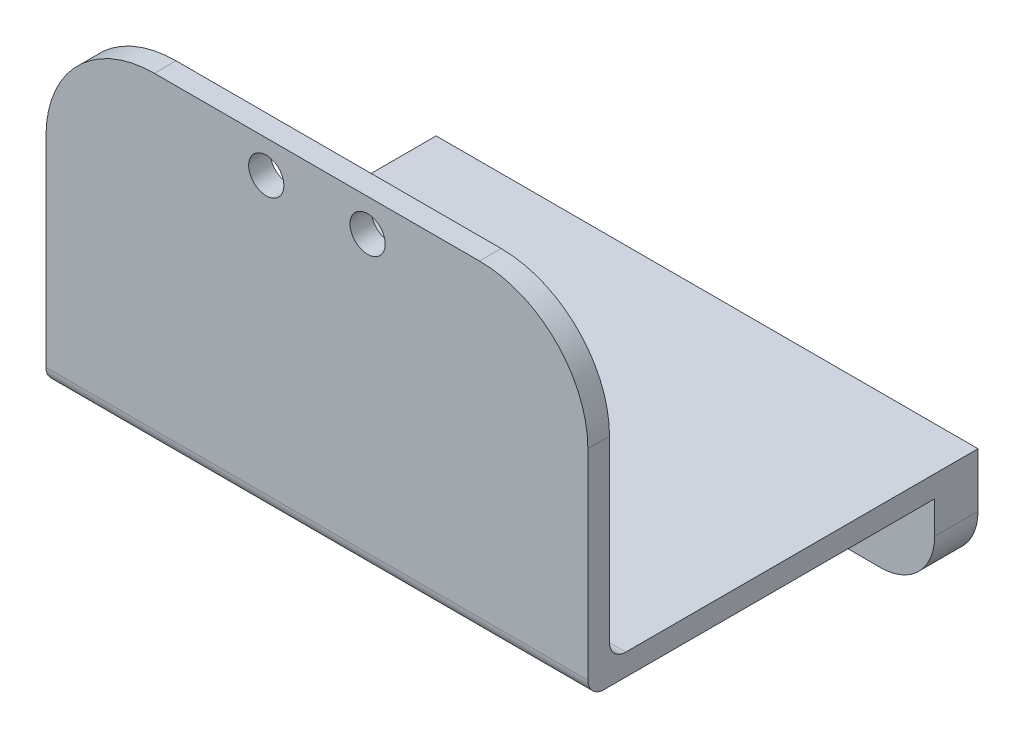
ISO-10303-21;
HEADER;
FILE_DESCRIPTION(('STEP AP214'),'2;1');
FILE_NAME('part.step','',(''),(''),'','','');
FILE_SCHEMA(('AUTOMOTIVE_DESIGN { 1 0 10303 214 1 1 1 1 }'));
ENDSEC;
DATA;
#1=APPLICATION_CONTEXT('core data for automotive mechanical design processes');
#2=APPLICATION_PROTOCOL_DEFINITION('international standard','automotive_design',2000,#1);
#3=PRODUCT_CONTEXT('',#1,'mechanical');
#4=PRODUCT('Part','Part','',(#3));
#5=PRODUCT_RELATED_PRODUCT_CATEGORY('part','',(#4));
#6=PRODUCT_DEFINITION_FORMATION('','',#4);
#7=PRODUCT_DEFINITION_CONTEXT('part definition',#1,'design');
#8=PRODUCT_DEFINITION('design','',#6,#7);
#9=PRODUCT_DEFINITION_SHAPE('','',#8);
#10=(LENGTH_UNIT() NAMED_UNIT(*) SI_UNIT(.MILLI.,.METRE.));
#11=(NAMED_UNIT(*) PLANE_ANGLE_UNIT() SI_UNIT($,.RADIAN.));
#12=(NAMED_UNIT(*) SI_UNIT($,.STERADIAN.) SOLID_ANGLE_UNIT());
#13=UNCERTAINTY_MEASURE_WITH_UNIT(LENGTH_MEASURE(1.E-05),#10,'distance_accuracy_value','');
#14=(GEOMETRIC_REPRESENTATION_CONTEXT(3) GLOBAL_UNCERTAINTY_ASSIGNED_CONTEXT((#13)) GLOBAL_UNIT_ASSIGNED_CONTEXT((#10,
#11,#12)) REPRESENTATION_CONTEXT('',''));
#15=CARTESIAN_POINT('',(0.,0.,0.));
#16=DIRECTION('',(0.,0.,1.));
#17=DIRECTION('',(1.,0.,0.));
#18=AXIS2_PLACEMENT_3D('',#15,#16,#17);
#19=CARTESIAN_POINT('',(0.,0.,4.));
#20=DIRECTION('',(0.,0.,1.));
#21=DIRECTION('',(1.,0.,0.));
#22=AXIS2_PLACEMENT_3D('',#19,#20,#21);
#23=PLANE('',#22);
#24=CARTESIAN_POINT('',(-41.1805538974397,15.0537235541443,4.));
#25=DIRECTION('',(0.,0.,1.));
#26=DIRECTION('',(1.,0.,0.));
#27=AXIS2_PLACEMENT_3D('',#24,#25,#26);
#28=CIRCLE('',#27,1.5);
#29=CARTESIAN_POINT('',(-39.6805538974397,15.0537235541443,4.));
#30=VERTEX_POINT('',#29);
#31=EDGE_CURVE('E181',#30,#30,#28,.T.);
#32=ORIENTED_EDGE('',*,*,#31,.F.);
#33=EDGE_LOOP('',(#32));
#34=FACE_BOUND('',#33,.T.);
#35=DIRECTION('',(0.,-1.,0.));
#36=VECTOR('',#35,1.);
#37=CARTESIAN_POINT('',(-54.0429117831077,19.0537235541443,4.));
#38=LINE('',#37,#36);
#39=CARTESIAN_POINT('',(-54.0429117831077,19.0537235541443,4.));
#40=VERTEX_POINT('',#39);
#41=CARTESIAN_POINT('',(-54.0429117831077,16.0537235541443,4.));
#42=VERTEX_POINT('',#41);
#43=EDGE_CURVE('E143',#40,#42,#38,.T.);
#44=ORIENTED_EDGE('',*,*,#43,.T.);
#45=CARTESIAN_POINT('',(-49.0429117831077,16.0537235541443,4.));
#46=DIRECTION('',(0.,0.,1.));
#47=DIRECTION('',(1.,0.,0.));
#48=AXIS2_PLACEMENT_3D('',#45,#46,#47);
#49=CIRCLE('',#48,5.);
#50=CARTESIAN_POINT('',(-49.0429117831077,11.0537235541443,4.));
#51=VERTEX_POINT('',#50);
#52=EDGE_CURVE('E212',#42,#51,#49,.T.);
#53=ORIENTED_EDGE('',*,*,#52,.T.);
#54=DIRECTION('',(1.,0.,0.));
#55=VECTOR('',#54,1.);
#56=CARTESIAN_POINT('',(-54.0429117831077,11.0537235541443,4.));
#57=LINE('',#56,#55);
#58=CARTESIAN_POINT('',(-9.04291178310769,11.0537235541443,4.));
#59=VERTEX_POINT('',#58);
#60=EDGE_CURVE('E186',#51,#59,#57,.T.);
#61=ORIENTED_EDGE('',*,*,#60,.T.);
#62=CARTESIAN_POINT('',(-9.04291178310769,16.0537235541443,4.));
#63=DIRECTION('',(0.,0.,1.));
#64=DIRECTION('',(1.,0.,0.));
#65=AXIS2_PLACEMENT_3D('',#62,#63,#64);
#66=CIRCLE('',#65,5.);
#67=CARTESIAN_POINT('',(-4.04291178310769,16.0537235541443,4.));
#68=VERTEX_POINT('',#67);
#69=EDGE_CURVE('E210',#59,#68,#66,.T.);
#70=ORIENTED_EDGE('',*,*,#69,.T.);
#71=DIRECTION('',(0.,1.,0.));
#72=VECTOR('',#71,1.);
#73=CARTESIAN_POINT('',(-4.04291178310769,19.0537235541443,4.));
#74=LINE('',#73,#72);
#75=CARTESIAN_POINT('',(-4.04291178310769,19.0537235541443,4.));
#76=VERTEX_POINT('',#75);
#77=EDGE_CURVE('E189',#68,#76,#74,.T.);
#78=ORIENTED_EDGE('',*,*,#77,.T.);
#79=DIRECTION('',(-1.,0.,0.));
#80=VECTOR('',#79,1.);
#81=CARTESIAN_POINT('',(-54.0429117831077,19.0537235541443,4.));
#82=LINE('',#81,#80);
#83=EDGE_CURVE('E194',#76,#40,#82,.T.);
#84=ORIENTED_EDGE('',*,*,#83,.T.);
#85=EDGE_LOOP('',(#44,#53,#61,#70,#78,#84));
#86=FACE_BOUND('',#85,.T.);
#87=CARTESIAN_POINT('',(-16.9052696687757,15.0537235541443,4.));
#88=DIRECTION('',(0.,0.,1.));
#89=DIRECTION('',(-1.,0.,0.));
#90=AXIS2_PLACEMENT_3D('',#87,#88,#89);
#91=CIRCLE('',#90,1.5);
#92=CARTESIAN_POINT('',(-18.4052696687757,15.0537235541443,4.));
#93=VERTEX_POINT('',#92);
#94=EDGE_CURVE('E174',#93,#93,#91,.T.);
#95=ORIENTED_EDGE('',*,*,#94,.F.);
#96=EDGE_LOOP('',(#95));
#97=FACE_BOUND('',#96,.T.);
#98=ADVANCED_FACE('F33',(#34,#86,#97),#23,.T.);
#99=CARTESIAN_POINT('',(0.,0.,0.));
#100=DIRECTION('',(0.,0.,1.));
#101=DIRECTION('',(1.,0.,0.));
#102=AXIS2_PLACEMENT_3D('',#99,#100,#101);
#103=PLANE('',#102);
#104=CARTESIAN_POINT('',(-41.1805538974397,15.0537235541443,0.));
#105=DIRECTION('',(0.,0.,1.));
#106=DIRECTION('',(1.,0.,0.));
#107=AXIS2_PLACEMENT_3D('',#104,#105,#106);
#108=CIRCLE('',#107,1.5);
#109=CARTESIAN_POINT('',(-39.6805538974397,15.0537235541443,0.));
#110=VERTEX_POINT('',#109);
#111=EDGE_CURVE('E177',#110,#110,#108,.T.);
#112=ORIENTED_EDGE('',*,*,#111,.T.);
#113=EDGE_LOOP('',(#112));
#114=FACE_BOUND('',#113,.T.);
#115=DIRECTION('',(1.,0.,0.));
#116=VECTOR('',#115,1.);
#117=CARTESIAN_POINT('',(-54.0429117831077,11.0537235541443,0.));
#118=LINE('',#117,#116);
#119=CARTESIAN_POINT('',(-49.0429117831077,11.0537235541443,0.));
#120=VERTEX_POINT('',#119);
#121=CARTESIAN_POINT('',(-9.04291178310769,11.0537235541443,0.));
#122=VERTEX_POINT('',#121);
#123=EDGE_CURVE('E144',#120,#122,#118,.T.);
#124=ORIENTED_EDGE('',*,*,#123,.F.);
#125=CARTESIAN_POINT('',(-49.0429117831077,16.0537235541443,0.));
#126=DIRECTION('',(0.,0.,1.));
#127=DIRECTION('',(1.,0.,0.));
#128=AXIS2_PLACEMENT_3D('',#125,#126,#127);
#129=CIRCLE('',#128,5.);
#130=CARTESIAN_POINT('',(-54.0429117831077,16.0537235541443,0.));
#131=VERTEX_POINT('',#130);
#132=EDGE_CURVE('E301',#120,#131,#129,.F.);
#133=ORIENTED_EDGE('',*,*,#132,.T.);
#134=DIRECTION('',(0.,-1.,0.));
#135=VECTOR('',#134,1.);
#136=CARTESIAN_POINT('',(-54.0429117831077,19.0537235541443,0.));
#137=LINE('',#136,#135);
#138=CARTESIAN_POINT('',(-54.0429117831077,21.0537235541443,0.));
#139=VERTEX_POINT('',#138);
#140=EDGE_CURVE('E156',#139,#131,#137,.T.);
#141=ORIENTED_EDGE('',*,*,#140,.F.);
#142=DIRECTION('',(-1.,0.,0.));
#143=VECTOR('',#142,1.);
#144=CARTESIAN_POINT('',(-54.0429117831077,21.0537235541443,0.));
#145=LINE('',#144,#143);
#146=CARTESIAN_POINT('',(-4.04291178310769,21.0537235541443,0.));
#147=VERTEX_POINT('',#146);
#148=EDGE_CURVE('E148',#147,#139,#145,.T.);
#149=ORIENTED_EDGE('',*,*,#148,.F.);
#150=DIRECTION('',(0.,1.,0.));
#151=VECTOR('',#150,1.);
#152=CARTESIAN_POINT('',(-4.04291178310769,19.0537235541443,0.));
#153=LINE('',#152,#151);
#154=CARTESIAN_POINT('',(-4.04291178310769,16.0537235541443,0.));
#155=VERTEX_POINT('',#154);
#156=EDGE_CURVE('E134',#155,#147,#153,.T.);
#157=ORIENTED_EDGE('',*,*,#156,.F.);
#158=CARTESIAN_POINT('',(-9.04291178310769,16.0537235541443,0.));
#159=DIRECTION('',(0.,0.,1.));
#160=DIRECTION('',(1.,0.,0.));
#161=AXIS2_PLACEMENT_3D('',#158,#159,#160);
#162=CIRCLE('',#161,5.);
#163=EDGE_CURVE('E302',#155,#122,#162,.F.);
#164=ORIENTED_EDGE('',*,*,#163,.T.);
#165=EDGE_LOOP('',(#124,#133,#141,#149,#157,#164));
#166=FACE_BOUND('',#165,.T.);
#167=CARTESIAN_POINT('',(-16.9052696687757,15.0537235541443,0.));
#168=DIRECTION('',(0.,0.,1.));
#169=DIRECTION('',(-1.,0.,0.));
#170=AXIS2_PLACEMENT_3D('',#167,#168,#169);
#171=CIRCLE('',#170,1.5);
#172=CARTESIAN_POINT('',(-18.4052696687757,15.0537235541443,0.));
#173=VERTEX_POINT('',#172);
#174=EDGE_CURVE('E178',#173,#173,#171,.T.);
#175=ORIENTED_EDGE('',*,*,#174,.T.);
#176=EDGE_LOOP('',(#175));
#177=FACE_BOUND('',#176,.T.);
#178=ADVANCED_FACE('F153',(#114,#166,#177),#103,.F.);
#179=CARTESIAN_POINT('',(-54.0429117831077,19.0537235541443,4.));
#180=DIRECTION('',(1.,0.,0.));
#181=DIRECTION('',(0.,1.,0.));
#182=AXIS2_PLACEMENT_3D('',#179,#180,#181);
#183=PLANE('',#182);
#184=DIRECTION('',(0.,0.,1.));
#185=VECTOR('',#184,1.);
#186=CARTESIAN_POINT('',(-54.0429117831077,19.0537235541443,0.));
#187=LINE('',#186,#185);
#188=CARTESIAN_POINT('',(-54.0429117831077,19.0537235541443,34.5));
#189=VERTEX_POINT('',#188);
#190=EDGE_CURVE('E158',#40,#189,#187,.T.);
#191=ORIENTED_EDGE('',*,*,#190,.T.);
#192=CARTESIAN_POINT('',(-54.0429117831077,20.5537235541443,34.5));
#193=DIRECTION('',(1.,0.,0.));
#194=DIRECTION('',(0.,1.,0.));
#195=AXIS2_PLACEMENT_3D('',#192,#193,#194);
#196=CIRCLE('',#195,1.5);
#197=CARTESIAN_POINT('',(-54.0429117831077,20.5537235541443,36.));
#198=VERTEX_POINT('',#197);
#199=EDGE_CURVE('E218',#189,#198,#196,.F.);
#200=ORIENTED_EDGE('',*,*,#199,.T.);
#201=DIRECTION('',(0.,1.,0.));
#202=VECTOR('',#201,1.);
#203=CARTESIAN_POINT('',(-54.0429117831077,19.0537235541443,36.));
#204=LINE('',#203,#202);
#205=CARTESIAN_POINT('',(-54.0429117831077,39.0537235541443,36.));
#206=VERTEX_POINT('',#205);
#207=EDGE_CURVE('E243',#198,#206,#204,.T.);
#208=ORIENTED_EDGE('',*,*,#207,.T.);
#209=DIRECTION('',(0.,0.,-1.));
#210=VECTOR('',#209,1.);
#211=CARTESIAN_POINT('',(-54.0429117831077,39.0537235541443,34.));
#212=LINE('',#211,#210);
#213=CARTESIAN_POINT('',(-54.0429117831077,39.0537235541443,34.));
#214=VERTEX_POINT('',#213);
#215=EDGE_CURVE('E310',#206,#214,#212,.T.);
#216=ORIENTED_EDGE('',*,*,#215,.T.);
#217=DIRECTION('',(0.,-1.,0.));
#218=VECTOR('',#217,1.);
#219=CARTESIAN_POINT('',(-54.0429117831077,19.0537235541443,34.));
#220=LINE('',#219,#218);
#221=CARTESIAN_POINT('',(-54.0429117831077,22.5537235541443,34.));
#222=VERTEX_POINT('',#221);
#223=EDGE_CURVE('E232',#214,#222,#220,.T.);
#224=ORIENTED_EDGE('',*,*,#223,.T.);
#225=CARTESIAN_POINT('',(-54.0429117831077,22.5537235541443,32.5));
#226=DIRECTION('',(1.,0.,0.));
#227=DIRECTION('',(0.,1.,0.));
#228=AXIS2_PLACEMENT_3D('',#225,#226,#227);
#229=CIRCLE('',#228,1.5);
#230=CARTESIAN_POINT('',(-54.0429117831077,21.0537235541443,32.5));
#231=VERTEX_POINT('',#230);
#232=EDGE_CURVE('E41',#222,#231,#229,.T.);
#233=ORIENTED_EDGE('',*,*,#232,.T.);
#234=DIRECTION('',(0.,0.,1.));
#235=VECTOR('',#234,1.);
#236=CARTESIAN_POINT('',(-54.0429117831077,21.0537235541443,0.));
#237=LINE('',#236,#235);
#238=EDGE_CURVE('E149',#139,#231,#237,.T.);
#239=ORIENTED_EDGE('',*,*,#238,.F.);
#240=ORIENTED_EDGE('',*,*,#140,.T.);
#241=DIRECTION('',(0.,0.,-1.));
#242=VECTOR('',#241,1.);
#243=CARTESIAN_POINT('',(-54.0429117831077,16.0537235541443,4.));
#244=LINE('',#243,#242);
#245=EDGE_CURVE('E208',#131,#42,#244,.F.);
#246=ORIENTED_EDGE('',*,*,#245,.T.);
#247=ORIENTED_EDGE('',*,*,#43,.F.);
#248=EDGE_LOOP('',(#191,#200,#208,#216,#224,#233,#239,#240,#246,#247));
#249=FACE_BOUND('',#248,.T.);
#250=ADVANCED_FACE('F229',(#249),#183,.F.);
#251=CARTESIAN_POINT('',(-54.0429117831077,11.0537235541443,4.));
#252=DIRECTION('',(0.,1.,0.));
#253=DIRECTION('',(-1.,0.,0.));
#254=AXIS2_PLACEMENT_3D('',#251,#252,#253);
#255=PLANE('',#254);
#256=ORIENTED_EDGE('',*,*,#60,.F.);
#257=DIRECTION('',(0.,0.,-1.));
#258=VECTOR('',#257,1.);
#259=CARTESIAN_POINT('',(-49.0429117831077,11.0537235541443,4.));
#260=LINE('',#259,#258);
#261=EDGE_CURVE('E303',#51,#120,#260,.T.);
#262=ORIENTED_EDGE('',*,*,#261,.T.);
#263=ORIENTED_EDGE('',*,*,#123,.T.);
#264=DIRECTION('',(0.,0.,-1.));
#265=VECTOR('',#264,1.);
#266=CARTESIAN_POINT('',(-9.04291178310769,11.0537235541443,4.));
#267=LINE('',#266,#265);
#268=EDGE_CURVE('E308',#122,#59,#267,.F.);
#269=ORIENTED_EDGE('',*,*,#268,.T.);
#270=EDGE_LOOP('',(#256,#262,#263,#269));
#271=FACE_BOUND('',#270,.T.);
#272=ADVANCED_FACE('F355',(#271),#255,.F.);
#273=CARTESIAN_POINT('',(-4.04291178310769,19.0537235541443,4.));
#274=DIRECTION('',(-1.,0.,0.));
#275=DIRECTION('',(0.,-1.,0.));
#276=AXIS2_PLACEMENT_3D('',#273,#274,#275);
#277=PLANE('',#276);
#278=DIRECTION('',(0.,1.,0.));
#279=VECTOR('',#278,1.);
#280=CARTESIAN_POINT('',(-4.04291178310769,19.0537235541442,36.));
#281=LINE('',#280,#279);
#282=CARTESIAN_POINT('',(-4.04291178310768,20.5537235541443,36.));
#283=VERTEX_POINT('',#282);
#284=CARTESIAN_POINT('',(-4.04291178310767,39.0537235541442,36.));
#285=VERTEX_POINT('',#284);
#286=EDGE_CURVE('E242',#283,#285,#281,.T.);
#287=ORIENTED_EDGE('',*,*,#286,.F.);
#288=CARTESIAN_POINT('',(-4.04291178310769,20.5537235541443,34.5));
#289=DIRECTION('',(-1.,0.,0.));
#290=DIRECTION('',(0.,-1.,0.));
#291=AXIS2_PLACEMENT_3D('',#288,#289,#290);
#292=CIRCLE('',#291,1.5);
#293=CARTESIAN_POINT('',(-4.04291178310769,19.0537235541443,34.5));
#294=VERTEX_POINT('',#293);
#295=EDGE_CURVE('E222',#283,#294,#292,.F.);
#296=ORIENTED_EDGE('',*,*,#295,.T.);
#297=DIRECTION('',(0.,0.,1.));
#298=VECTOR('',#297,1.);
#299=CARTESIAN_POINT('',(-4.04291178310769,19.0537235541443,0.));
#300=LINE('',#299,#298);
#301=EDGE_CURVE('E150',#76,#294,#300,.T.);
#302=ORIENTED_EDGE('',*,*,#301,.F.);
#303=ORIENTED_EDGE('',*,*,#77,.F.);
#304=DIRECTION('',(0.,0.,-1.));
#305=VECTOR('',#304,1.);
#306=CARTESIAN_POINT('',(-4.04291178310769,16.0537235541443,4.));
#307=LINE('',#306,#305);
#308=EDGE_CURVE('E140',#68,#155,#307,.T.);
#309=ORIENTED_EDGE('',*,*,#308,.T.);
#310=ORIENTED_EDGE('',*,*,#156,.T.);
#311=DIRECTION('',(0.,0.,1.));
#312=VECTOR('',#311,1.);
#313=CARTESIAN_POINT('',(-4.04291178310769,21.0537235541443,0.));
#314=LINE('',#313,#312);
#315=CARTESIAN_POINT('',(-4.04291178310769,21.0537235541443,32.5));
#316=VERTEX_POINT('',#315);
#317=EDGE_CURVE('E137',#147,#316,#314,.T.);
#318=ORIENTED_EDGE('',*,*,#317,.T.);
#319=CARTESIAN_POINT('',(-4.04291178310769,22.5537235541443,32.5));
#320=DIRECTION('',(-1.,0.,0.));
#321=DIRECTION('',(0.,-1.,0.));
#322=AXIS2_PLACEMENT_3D('',#319,#320,#321);
#323=CIRCLE('',#322,1.5);
#324=CARTESIAN_POINT('',(-4.04291178310768,22.5537235541443,34.));
#325=VERTEX_POINT('',#324);
#326=EDGE_CURVE('E11',#316,#325,#323,.T.);
#327=ORIENTED_EDGE('',*,*,#326,.T.);
#328=DIRECTION('',(0.,-1.,0.));
#329=VECTOR('',#328,1.);
#330=CARTESIAN_POINT('',(-4.04291178310769,19.0537235541442,34.));
#331=LINE('',#330,#329);
#332=CARTESIAN_POINT('',(-4.04291178310767,39.0537235541442,34.));
#333=VERTEX_POINT('',#332);
#334=EDGE_CURVE('E237',#333,#325,#331,.T.);
#335=ORIENTED_EDGE('',*,*,#334,.F.);
#336=DIRECTION('',(0.,0.,-1.));
#337=VECTOR('',#336,1.);
#338=CARTESIAN_POINT('',(-4.0429117831077,39.0537235541442,36.));
#339=LINE('',#338,#337);
#340=EDGE_CURVE('E315',#333,#285,#339,.F.);
#341=ORIENTED_EDGE('',*,*,#340,.T.);
#342=EDGE_LOOP('',(#287,#296,#302,#303,#309,#310,#318,#327,#335,#341));
#343=FACE_BOUND('',#342,.T.);
#344=ADVANCED_FACE('F136',(#343),#277,.F.);
#345=CARTESIAN_POINT('',(-41.1805538974397,15.0537235541443,4.));
#346=DIRECTION('',(0.,0.,-1.));
#347=DIRECTION('',(-1.,0.,0.));
#348=AXIS2_PLACEMENT_3D('',#345,#346,#347);
#349=CYLINDRICAL_SURFACE('',#348,1.5);
#350=ORIENTED_EDGE('',*,*,#31,.T.);
#351=EDGE_LOOP('',(#350));
#352=FACE_BOUND('',#351,.T.);
#353=ORIENTED_EDGE('',*,*,#111,.F.);
#354=EDGE_LOOP('',(#353));
#355=FACE_BOUND('',#354,.T.);
#356=ADVANCED_FACE('F350',(#352,#355),#349,.F.);
#357=CARTESIAN_POINT('',(-16.9052696687757,15.0537235541443,4.));
#358=DIRECTION('',(0.,0.,-1.));
#359=DIRECTION('',(-1.,0.,0.));
#360=AXIS2_PLACEMENT_3D('',#357,#358,#359);
#361=CYLINDRICAL_SURFACE('',#360,1.5);
#362=ORIENTED_EDGE('',*,*,#94,.T.);
#363=EDGE_LOOP('',(#362));
#364=FACE_BOUND('',#363,.T.);
#365=ORIENTED_EDGE('',*,*,#174,.F.);
#366=EDGE_LOOP('',(#365));
#367=FACE_BOUND('',#366,.T.);
#368=ADVANCED_FACE('F381',(#364,#367),#361,.F.);
#369=CARTESIAN_POINT('',(-54.0429117831077,19.0537235541443,0.));
#370=DIRECTION('',(0.,-1.,0.));
#371=DIRECTION('',(0.,0.,-1.));
#372=AXIS2_PLACEMENT_3D('',#369,#370,#371);
#373=PLANE('',#372);
#374=ORIENTED_EDGE('',*,*,#301,.T.);
#375=DIRECTION('',(-1.,0.,0.));
#376=VECTOR('',#375,1.);
#377=CARTESIAN_POINT('',(-54.0429117831077,19.0537235541443,34.5));
#378=LINE('',#377,#376);
#379=EDGE_CURVE('E215',#294,#189,#378,.T.);
#380=ORIENTED_EDGE('',*,*,#379,.T.);
#381=ORIENTED_EDGE('',*,*,#190,.F.);
#382=ORIENTED_EDGE('',*,*,#83,.F.);
#383=EDGE_LOOP('',(#374,#380,#381,#382));
#384=FACE_BOUND('',#383,.T.);
#385=ADVANCED_FACE('F294',(#384),#373,.T.);
#386=CARTESIAN_POINT('',(-54.0429117831077,21.0537235541443,0.));
#387=DIRECTION('',(0.,1.,0.));
#388=DIRECTION('',(0.,0.,1.));
#389=AXIS2_PLACEMENT_3D('',#386,#387,#388);
#390=PLANE('',#389);
#391=ORIENTED_EDGE('',*,*,#238,.T.);
#392=DIRECTION('',(-1.,0.,0.));
#393=VECTOR('',#392,1.);
#394=CARTESIAN_POINT('',(-4.04291178310771,21.0537235541443,32.5));
#395=LINE('',#394,#393);
#396=EDGE_CURVE('E54',#231,#316,#395,.F.);
#397=ORIENTED_EDGE('',*,*,#396,.T.);
#398=ORIENTED_EDGE('',*,*,#317,.F.);
#399=ORIENTED_EDGE('',*,*,#148,.T.);
#400=EDGE_LOOP('',(#391,#397,#398,#399));
#401=FACE_BOUND('',#400,.T.);
#402=ADVANCED_FACE('F147',(#401),#390,.T.);
#403=CARTESIAN_POINT('',(-4.04291178310769,19.0537235541442,34.));
#404=DIRECTION('',(0.,0.,-1.));
#405=DIRECTION('',(-1.,0.,0.));
#406=AXIS2_PLACEMENT_3D('',#403,#404,#405);
#407=PLANE('',#406);
#408=CARTESIAN_POINT('',(-33.7179117831077,46.0537235541443,34.));
#409=DIRECTION('',(0.,0.,-1.));
#410=DIRECTION('',(-1.,0.,0.));
#411=AXIS2_PLACEMENT_3D('',#408,#409,#410);
#412=CIRCLE('',#411,1.625);
#413=CARTESIAN_POINT('',(-35.3429117831077,46.0537235541443,34.));
#414=VERTEX_POINT('',#413);
#415=EDGE_CURVE('E263',#414,#414,#412,.T.);
#416=ORIENTED_EDGE('',*,*,#415,.F.);
#417=EDGE_LOOP('',(#416));
#418=FACE_BOUND('',#417,.T.);
#419=CARTESIAN_POINT('',(-24.3679117831077,46.0537235541443,34.));
#420=DIRECTION('',(0.,0.,-1.));
#421=DIRECTION('',(-1.,0.,0.));
#422=AXIS2_PLACEMENT_3D('',#419,#420,#421);
#423=CIRCLE('',#422,1.625);
#424=CARTESIAN_POINT('',(-25.9929117831077,46.0537235541443,34.));
#425=VERTEX_POINT('',#424);
#426=EDGE_CURVE('E256',#425,#425,#423,.T.);
#427=ORIENTED_EDGE('',*,*,#426,.F.);
#428=EDGE_LOOP('',(#427));
#429=FACE_BOUND('',#428,.T.);
#430=ORIENTED_EDGE('',*,*,#334,.T.);
#431=DIRECTION('',(-1.,0.,0.));
#432=VECTOR('',#431,1.);
#433=CARTESIAN_POINT('',(-54.0429117831077,22.5537235541443,34.));
#434=LINE('',#433,#432);
#435=EDGE_CURVE('E224',#325,#222,#434,.T.);
#436=ORIENTED_EDGE('',*,*,#435,.T.);
#437=ORIENTED_EDGE('',*,*,#223,.F.);
#438=CARTESIAN_POINT('',(-44.0429117831077,39.0537235541443,34.));
#439=DIRECTION('',(0.,0.,-1.));
#440=DIRECTION('',(-1.,0.,0.));
#441=AXIS2_PLACEMENT_3D('',#438,#439,#440);
#442=CIRCLE('',#441,10.);
#443=CARTESIAN_POINT('',(-44.0429117831077,49.0537235541443,34.));
#444=VERTEX_POINT('',#443);
#445=EDGE_CURVE('E317',#214,#444,#442,.T.);
#446=ORIENTED_EDGE('',*,*,#445,.T.);
#447=DIRECTION('',(-1.,0.,0.));
#448=VECTOR('',#447,1.);
#449=CARTESIAN_POINT('',(-4.04291178310766,49.0537235541442,34.));
#450=LINE('',#449,#448);
#451=CARTESIAN_POINT('',(-14.0429117831077,49.0537235541442,34.));
#452=VERTEX_POINT('',#451);
#453=EDGE_CURVE('E159',#452,#444,#450,.T.);
#454=ORIENTED_EDGE('',*,*,#453,.F.);
#455=CARTESIAN_POINT('',(-14.0429117831077,39.0537235541442,34.));
#456=DIRECTION('',(0.,0.,-1.));
#457=DIRECTION('',(-1.,0.,0.));
#458=AXIS2_PLACEMENT_3D('',#455,#456,#457);
#459=CIRCLE('',#458,10.);
#460=EDGE_CURVE('E239',#452,#333,#459,.T.);
#461=ORIENTED_EDGE('',*,*,#460,.T.);
#462=EDGE_LOOP('',(#430,#436,#437,#446,#454,#461));
#463=FACE_BOUND('',#462,.T.);
#464=ADVANCED_FACE('F236',(#418,#429,#463),#407,.T.);
#465=CARTESIAN_POINT('',(-4.04291178310766,49.0537235541442,34.));
#466=DIRECTION('',(0.,1.,0.));
#467=DIRECTION('',(-1.,0.,0.));
#468=AXIS2_PLACEMENT_3D('',#465,#466,#467);
#469=PLANE('',#468);
#470=DIRECTION('',(-1.,0.,0.));
#471=VECTOR('',#470,1.);
#472=CARTESIAN_POINT('',(-4.04291178310766,49.0537235541442,36.));
#473=LINE('',#472,#471);
#474=CARTESIAN_POINT('',(-14.0429117831077,49.0537235541442,36.));
#475=VERTEX_POINT('',#474);
#476=CARTESIAN_POINT('',(-44.0429117831077,49.0537235541443,36.));
#477=VERTEX_POINT('',#476);
#478=EDGE_CURVE('E164',#475,#477,#473,.T.);
#479=ORIENTED_EDGE('',*,*,#478,.F.);
#480=DIRECTION('',(0.,0.,-1.));
#481=VECTOR('',#480,1.);
#482=CARTESIAN_POINT('',(-14.0429117831077,49.0537235541442,34.));
#483=LINE('',#482,#481);
#484=EDGE_CURVE('E250',#475,#452,#483,.T.);
#485=ORIENTED_EDGE('',*,*,#484,.T.);
#486=ORIENTED_EDGE('',*,*,#453,.T.);
#487=DIRECTION('',(0.,0.,-1.));
#488=VECTOR('',#487,1.);
#489=CARTESIAN_POINT('',(-44.0429117831077,49.0537235541443,36.));
#490=LINE('',#489,#488);
#491=EDGE_CURVE('E197',#444,#477,#490,.F.);
#492=ORIENTED_EDGE('',*,*,#491,.T.);
#493=EDGE_LOOP('',(#479,#485,#486,#492));
#494=FACE_BOUND('',#493,.T.);
#495=ADVANCED_FACE('F276',(#494),#469,.T.);
#496=CARTESIAN_POINT('',(-4.04291178310769,19.0537235541442,36.));
#497=DIRECTION('',(0.,0.,1.));
#498=DIRECTION('',(1.,0.,0.));
#499=AXIS2_PLACEMENT_3D('',#496,#497,#498);
#500=PLANE('',#499);
#501=CARTESIAN_POINT('',(-33.7179117831077,46.0537235541443,36.));
#502=DIRECTION('',(0.,0.,1.));
#503=DIRECTION('',(-1.,0.,0.));
#504=AXIS2_PLACEMENT_3D('',#501,#502,#503);
#505=CIRCLE('',#504,1.625);
#506=CARTESIAN_POINT('',(-35.3429117831077,46.0537235541443,36.));
#507=VERTEX_POINT('',#506);
#508=EDGE_CURVE('E266',#507,#507,#505,.T.);
#509=ORIENTED_EDGE('',*,*,#508,.F.);
#510=EDGE_LOOP('',(#509));
#511=FACE_BOUND('',#510,.T.);
#512=CARTESIAN_POINT('',(-24.3679117831077,46.0537235541443,36.));
#513=DIRECTION('',(0.,0.,1.));
#514=DIRECTION('',(1.,0.,0.));
#515=AXIS2_PLACEMENT_3D('',#512,#513,#514);
#516=CIRCLE('',#515,1.625);
#517=CARTESIAN_POINT('',(-22.7429117831077,46.0537235541443,36.));
#518=VERTEX_POINT('',#517);
#519=EDGE_CURVE('E260',#518,#518,#516,.T.);
#520=ORIENTED_EDGE('',*,*,#519,.F.);
#521=EDGE_LOOP('',(#520));
#522=FACE_BOUND('',#521,.T.);
#523=ORIENTED_EDGE('',*,*,#207,.F.);
#524=DIRECTION('',(-1.,0.,0.));
#525=VECTOR('',#524,1.);
#526=CARTESIAN_POINT('',(-4.04291178310769,20.5537235541443,36.));
#527=LINE('',#526,#525);
#528=EDGE_CURVE('E220',#198,#283,#527,.F.);
#529=ORIENTED_EDGE('',*,*,#528,.T.);
#530=ORIENTED_EDGE('',*,*,#286,.T.);
#531=CARTESIAN_POINT('',(-14.0429117831077,39.0537235541442,36.));
#532=DIRECTION('',(0.,0.,1.));
#533=DIRECTION('',(1.,0.,0.));
#534=AXIS2_PLACEMENT_3D('',#531,#532,#533);
#535=CIRCLE('',#534,10.);
#536=EDGE_CURVE('E312',#285,#475,#535,.T.);
#537=ORIENTED_EDGE('',*,*,#536,.T.);
#538=ORIENTED_EDGE('',*,*,#478,.T.);
#539=CARTESIAN_POINT('',(-44.0429117831077,39.0537235541443,36.));
#540=DIRECTION('',(0.,0.,1.));
#541=DIRECTION('',(1.,0.,0.));
#542=AXIS2_PLACEMENT_3D('',#539,#540,#541);
#543=CIRCLE('',#542,10.);
#544=EDGE_CURVE('E285',#477,#206,#543,.T.);
#545=ORIENTED_EDGE('',*,*,#544,.T.);
#546=EDGE_LOOP('',(#523,#529,#530,#537,#538,#545));
#547=FACE_BOUND('',#546,.T.);
#548=ADVANCED_FACE('F272',(#511,#522,#547),#500,.T.);
#549=CARTESIAN_POINT('',(-14.0429117831077,39.0537235541442,34.));
#550=DIRECTION('',(0.,0.,1.));
#551=DIRECTION('',(1.,0.,0.));
#552=AXIS2_PLACEMENT_3D('',#549,#550,#551);
#553=CYLINDRICAL_SURFACE('',#552,10.);
#554=ORIENTED_EDGE('',*,*,#536,.F.);
#555=ORIENTED_EDGE('',*,*,#340,.F.);
#556=ORIENTED_EDGE('',*,*,#460,.F.);
#557=ORIENTED_EDGE('',*,*,#484,.F.);
#558=EDGE_LOOP('',(#554,#555,#556,#557));
#559=FACE_BOUND('',#558,.T.);
#560=ADVANCED_FACE('F275',(#559),#553,.T.);
#561=CARTESIAN_POINT('',(-44.0429117831077,39.0537235541443,4.));
#562=DIRECTION('',(0.,0.,1.));
#563=DIRECTION('',(1.,0.,0.));
#564=AXIS2_PLACEMENT_3D('',#561,#562,#563);
#565=CYLINDRICAL_SURFACE('',#564,10.);
#566=ORIENTED_EDGE('',*,*,#544,.F.);
#567=ORIENTED_EDGE('',*,*,#491,.F.);
#568=ORIENTED_EDGE('',*,*,#445,.F.);
#569=ORIENTED_EDGE('',*,*,#215,.F.);
#570=EDGE_LOOP('',(#566,#567,#568,#569));
#571=FACE_BOUND('',#570,.T.);
#572=ADVANCED_FACE('F328',(#571),#565,.T.);
#573=CARTESIAN_POINT('',(-49.0429117831077,16.0537235541443,4.));
#574=DIRECTION('',(0.,0.,-1.));
#575=DIRECTION('',(-1.,0.,0.));
#576=AXIS2_PLACEMENT_3D('',#573,#574,#575);
#577=CYLINDRICAL_SURFACE('',#576,5.);
#578=ORIENTED_EDGE('',*,*,#52,.F.);
#579=ORIENTED_EDGE('',*,*,#245,.F.);
#580=ORIENTED_EDGE('',*,*,#132,.F.);
#581=ORIENTED_EDGE('',*,*,#261,.F.);
#582=EDGE_LOOP('',(#578,#579,#580,#581));
#583=FACE_BOUND('',#582,.T.);
#584=ADVANCED_FACE('F330',(#583),#577,.T.);
#585=CARTESIAN_POINT('',(-9.04291178310769,16.0537235541443,4.));
#586=DIRECTION('',(0.,0.,-1.));
#587=DIRECTION('',(-1.,0.,0.));
#588=AXIS2_PLACEMENT_3D('',#585,#586,#587);
#589=CYLINDRICAL_SURFACE('',#588,5.);
#590=ORIENTED_EDGE('',*,*,#69,.F.);
#591=ORIENTED_EDGE('',*,*,#268,.F.);
#592=ORIENTED_EDGE('',*,*,#163,.F.);
#593=ORIENTED_EDGE('',*,*,#308,.F.);
#594=EDGE_LOOP('',(#590,#591,#592,#593));
#595=FACE_BOUND('',#594,.T.);
#596=ADVANCED_FACE('F336',(#595),#589,.T.);
#597=CARTESIAN_POINT('',(-54.0429117831077,20.5537235541443,34.5));
#598=DIRECTION('',(-1.,0.,0.));
#599=DIRECTION('',(0.,0.,1.));
#600=AXIS2_PLACEMENT_3D('',#597,#598,#599);
#601=CYLINDRICAL_SURFACE('',#600,1.5);
#602=ORIENTED_EDGE('',*,*,#295,.F.);
#603=ORIENTED_EDGE('',*,*,#528,.F.);
#604=ORIENTED_EDGE('',*,*,#199,.F.);
#605=ORIENTED_EDGE('',*,*,#379,.F.);
#606=EDGE_LOOP('',(#602,#603,#604,#605));
#607=FACE_BOUND('',#606,.T.);
#608=ADVANCED_FACE('F289',(#607),#601,.T.);
#609=CARTESIAN_POINT('',(-4.04291178310769,22.5537235541443,32.5));
#610=DIRECTION('',(1.,0.,0.));
#611=DIRECTION('',(0.,0.,-1.));
#612=AXIS2_PLACEMENT_3D('',#609,#610,#611);
#613=CYLINDRICAL_SURFACE('',#612,1.5);
#614=ORIENTED_EDGE('',*,*,#326,.F.);
#615=ORIENTED_EDGE('',*,*,#396,.F.);
#616=ORIENTED_EDGE('',*,*,#232,.F.);
#617=ORIENTED_EDGE('',*,*,#435,.F.);
#618=EDGE_LOOP('',(#614,#615,#616,#617));
#619=FACE_BOUND('',#618,.T.);
#620=ADVANCED_FACE('F35',(#619),#613,.F.);
#621=CARTESIAN_POINT('',(-24.3679117831077,46.0537235541443,23.));
#622=DIRECTION('',(0.,0.,1.));
#623=DIRECTION('',(1.,0.,0.));
#624=AXIS2_PLACEMENT_3D('',#621,#622,#623);
#625=CYLINDRICAL_SURFACE('',#624,1.625);
#626=ORIENTED_EDGE('',*,*,#426,.T.);
#627=EDGE_LOOP('',(#626));
#628=FACE_BOUND('',#627,.T.);
#629=ORIENTED_EDGE('',*,*,#519,.T.);
#630=EDGE_LOOP('',(#629));
#631=FACE_BOUND('',#630,.T.);
#632=ADVANCED_FACE('F498',(#628,#631),#625,.F.);
#633=CARTESIAN_POINT('',(-33.7179117831077,46.0537235541443,23.));
#634=DIRECTION('',(0.,0.,1.));
#635=DIRECTION('',(1.,0.,0.));
#636=AXIS2_PLACEMENT_3D('',#633,#634,#635);
#637=CYLINDRICAL_SURFACE('',#636,1.625);
#638=ORIENTED_EDGE('',*,*,#415,.T.);
#639=EDGE_LOOP('',(#638));
#640=FACE_BOUND('',#639,.T.);
#641=ORIENTED_EDGE('',*,*,#508,.T.);
#642=EDGE_LOOP('',(#641));
#643=FACE_BOUND('',#642,.T.);
#644=ADVANCED_FACE('F270',(#640,#643),#637,.F.);
#645=CLOSED_SHELL('',(#98,#178,#250,#272,#344,#356,#368,#385,#402,#464,#495,#548,#560,#572,#584,
#596,#608,#620,#632,#644));
#646=MANIFOLD_SOLID_BREP('B2',#645);
#647=ADVANCED_BREP_SHAPE_REPRESENTATION('',(#18,#646),#14);
#648=SHAPE_DEFINITION_REPRESENTATION(#9,#647);
ENDSEC;
END-ISO-10303-21;
